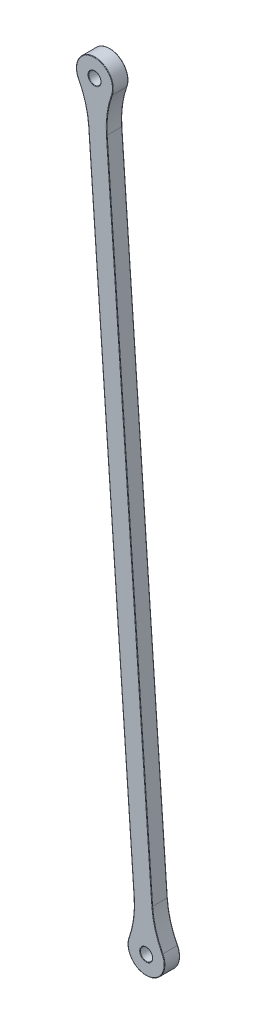
ISO-10303-21;
HEADER;
FILE_DESCRIPTION(('STEP AP214'),'2;1');
FILE_NAME('part.step','',(''),(''),'','','');
FILE_SCHEMA(('AUTOMOTIVE_DESIGN { 1 0 10303 214 1 1 1 1 }'));
ENDSEC;
DATA;
#1=APPLICATION_CONTEXT('core data for automotive mechanical design processes');
#2=APPLICATION_PROTOCOL_DEFINITION('international standard','automotive_design',2000,#1);
#3=PRODUCT_CONTEXT('',#1,'mechanical');
#4=PRODUCT('Part','Part','',(#3));
#5=PRODUCT_RELATED_PRODUCT_CATEGORY('part','',(#4));
#6=PRODUCT_DEFINITION_FORMATION('','',#4);
#7=PRODUCT_DEFINITION_CONTEXT('part definition',#1,'design');
#8=PRODUCT_DEFINITION('design','',#6,#7);
#9=PRODUCT_DEFINITION_SHAPE('','',#8);
#10=(LENGTH_UNIT() NAMED_UNIT(*) SI_UNIT(.MILLI.,.METRE.));
#11=(NAMED_UNIT(*) PLANE_ANGLE_UNIT() SI_UNIT($,.RADIAN.));
#12=(NAMED_UNIT(*) SI_UNIT($,.STERADIAN.) SOLID_ANGLE_UNIT());
#13=UNCERTAINTY_MEASURE_WITH_UNIT(LENGTH_MEASURE(1.E-05),#10,'distance_accuracy_value','');
#14=(GEOMETRIC_REPRESENTATION_CONTEXT(3) GLOBAL_UNCERTAINTY_ASSIGNED_CONTEXT((#13)) GLOBAL_UNIT_ASSIGNED_CONTEXT((#10,
#11,#12)) REPRESENTATION_CONTEXT('',''));
#15=CARTESIAN_POINT('',(0.,0.,0.));
#16=DIRECTION('',(0.,0.,1.));
#17=DIRECTION('',(1.,0.,0.));
#18=AXIS2_PLACEMENT_3D('',#15,#16,#17);
#19=CARTESIAN_POINT('',(33.0209516053081,48.5577457272989,-5.));
#20=DIRECTION('',(0.,0.,1.));
#21=DIRECTION('',(1.,0.,0.));
#22=AXIS2_PLACEMENT_3D('',#19,#20,#21);
#23=CYLINDRICAL_SURFACE('',#22,6.);
#24=DIRECTION('',(0.,0.,1.));
#25=VECTOR('',#24,1.);
#26=CARTESIAN_POINT('',(27.3661007024171,50.5634030425134,-5.));
#27=LINE('',#26,#25);
#28=CARTESIAN_POINT('',(27.3661007024171,50.5634030425134,-0.15));
#29=VERTEX_POINT('',#28);
#30=CARTESIAN_POINT('',(27.3661007024171,50.5634030425134,-4.85));
#31=VERTEX_POINT('',#30);
#32=EDGE_CURVE('E175',#29,#31,#27,.F.);
#33=ORIENTED_EDGE('',*,*,#32,.T.);
#34=CARTESIAN_POINT('',(33.0209516053081,48.5577457272989,-4.85));
#35=DIRECTION('',(0.,0.,1.));
#36=DIRECTION('',(1.,0.,0.));
#37=AXIS2_PLACEMENT_3D('',#34,#35,#36);
#38=CIRCLE('',#37,6.);
#39=CARTESIAN_POINT('',(38.3389298635249,51.3360738657903,-4.85));
#40=VERTEX_POINT('',#39);
#41=EDGE_CURVE('E234',#31,#40,#38,.T.);
#42=ORIENTED_EDGE('',*,*,#41,.T.);
#43=DIRECTION('',(0.,0.,1.));
#44=VECTOR('',#43,1.);
#45=CARTESIAN_POINT('',(38.3389298635249,51.3360738657903,-5.));
#46=LINE('',#45,#44);
#47=CARTESIAN_POINT('',(38.3389298635249,51.3360738657903,-0.15));
#48=VERTEX_POINT('',#47);
#49=EDGE_CURVE('E306',#40,#48,#46,.T.);
#50=ORIENTED_EDGE('',*,*,#49,.T.);
#51=CARTESIAN_POINT('',(33.0209516053081,48.5577457272989,-0.15));
#52=DIRECTION('',(0.,0.,1.));
#53=DIRECTION('',(1.,0.,0.));
#54=AXIS2_PLACEMENT_3D('',#51,#52,#53);
#55=CIRCLE('',#54,6.);
#56=EDGE_CURVE('E232',#48,#29,#55,.F.);
#57=ORIENTED_EDGE('',*,*,#56,.T.);
#58=EDGE_LOOP('',(#33,#42,#50,#57));
#59=FACE_BOUND('',#58,.T.);
#60=ADVANCED_FACE('F40',(#59),#23,.T.);
#61=CARTESIAN_POINT('',(33.26784187544,2.34261286611937,-5.));
#62=DIRECTION('',(0.997529923737068,0.070242802116079,0.));
#63=DIRECTION('',(-0.070242802116079,0.997529923737068,0.));
#64=AXIS2_PLACEMENT_3D('',#61,#62,#63);
#65=PLANE('',#64);
#66=DIRECTION('',(0.,0.,1.));
#67=VECTOR('',#66,1.);
#68=CARTESIAN_POINT('',(14.1807072602602,273.402242656729,-5.));
#69=LINE('',#68,#67);
#70=CARTESIAN_POINT('',(14.1807072602602,273.402242656729,-0.15));
#71=VERTEX_POINT('',#70);
#72=CARTESIAN_POINT('',(14.1807072602602,273.402242656729,-4.85));
#73=VERTEX_POINT('',#72);
#74=EDGE_CURVE('E311',#71,#73,#69,.F.);
#75=ORIENTED_EDGE('',*,*,#74,.T.);
#76=DIRECTION('',(-0.070242802116079,0.997529923737068,0.));
#77=VECTOR('',#76,1.);
#78=CARTESIAN_POINT('',(33.26784187544,2.34261286611937,-4.85));
#79=LINE('',#78,#77);
#80=CARTESIAN_POINT('',(29.0177439000745,62.6989736820684,-4.85));
#81=VERTEX_POINT('',#80);
#82=EDGE_CURVE('E226',#73,#81,#79,.F.);
#83=ORIENTED_EDGE('',*,*,#82,.T.);
#84=DIRECTION('',(0.,0.,1.));
#85=VECTOR('',#84,1.);
#86=CARTESIAN_POINT('',(29.0177439000745,62.6989736820684,-5.));
#87=LINE('',#86,#85);
#88=CARTESIAN_POINT('',(29.0177439000745,62.6989736820684,-0.15));
#89=VERTEX_POINT('',#88);
#90=EDGE_CURVE('E315',#81,#89,#87,.T.);
#91=ORIENTED_EDGE('',*,*,#90,.T.);
#92=DIRECTION('',(-0.070242802116079,0.997529923737068,0.));
#93=VECTOR('',#92,1.);
#94=CARTESIAN_POINT('',(14.1807072602602,273.402242656729,-0.15));
#95=LINE('',#94,#93);
#96=EDGE_CURVE('E224',#89,#71,#95,.T.);
#97=ORIENTED_EDGE('',*,*,#96,.T.);
#98=EDGE_LOOP('',(#75,#83,#91,#97));
#99=FACE_BOUND('',#98,.T.);
#100=ADVANCED_FACE('F352',(#99),#65,.F.);
#101=CARTESIAN_POINT('',(16.1626790974491,287.964927424195,-5.));
#102=DIRECTION('',(0.,0.,1.));
#103=DIRECTION('',(1.,0.,0.));
#104=AXIS2_PLACEMENT_3D('',#101,#102,#103);
#105=CYLINDRICAL_SURFACE('',#104,6.);
#106=DIRECTION('',(0.,0.,1.));
#107=VECTOR('',#106,1.);
#108=CARTESIAN_POINT('',(21.81753000034,285.959270108981,-5.));
#109=LINE('',#108,#107);
#110=CARTESIAN_POINT('',(21.81753000034,285.959270108981,-0.15));
#111=VERTEX_POINT('',#110);
#112=CARTESIAN_POINT('',(21.81753000034,285.959270108981,-4.85));
#113=VERTEX_POINT('',#112);
#114=EDGE_CURVE('E346',#111,#113,#109,.F.);
#115=ORIENTED_EDGE('',*,*,#114,.T.);
#116=CARTESIAN_POINT('',(16.1626790974491,287.964927424195,-4.85));
#117=DIRECTION('',(0.,0.,1.));
#118=DIRECTION('',(1.,0.,0.));
#119=AXIS2_PLACEMENT_3D('',#116,#117,#118);
#120=CIRCLE('',#119,6.);
#121=CARTESIAN_POINT('',(10.8447008392323,285.186599285704,-4.85));
#122=VERTEX_POINT('',#121);
#123=EDGE_CURVE('E217',#113,#122,#120,.T.);
#124=ORIENTED_EDGE('',*,*,#123,.T.);
#125=DIRECTION('',(0.,0.,1.));
#126=VECTOR('',#125,1.);
#127=CARTESIAN_POINT('',(10.8447008392323,285.186599285704,-5.));
#128=LINE('',#127,#126);
#129=CARTESIAN_POINT('',(10.8447008392323,285.186599285704,-0.15));
#130=VERTEX_POINT('',#129);
#131=EDGE_CURVE('E341',#122,#130,#128,.T.);
#132=ORIENTED_EDGE('',*,*,#131,.T.);
#133=CARTESIAN_POINT('',(16.1626790974491,287.964927424195,-0.15));
#134=DIRECTION('',(0.,0.,1.));
#135=DIRECTION('',(1.,0.,0.));
#136=AXIS2_PLACEMENT_3D('',#133,#134,#135);
#137=CIRCLE('',#136,6.);
#138=EDGE_CURVE('E215',#130,#111,#137,.F.);
#139=ORIENTED_EDGE('',*,*,#138,.T.);
#140=EDGE_LOOP('',(#115,#124,#132,#139));
#141=FACE_BOUND('',#140,.T.);
#142=ADVANCED_FACE('F376',(#141),#105,.T.);
#143=CARTESIAN_POINT('',(16.1626790974491,287.964927424195,-5.));
#144=DIRECTION('',(0.,0.,1.));
#145=DIRECTION('',(1.,0.,0.));
#146=AXIS2_PLACEMENT_3D('',#143,#144,#145);
#147=CYLINDRICAL_SURFACE('',#146,2.);
#148=CARTESIAN_POINT('',(16.1626790974491,287.964927424195,-4.85));
#149=DIRECTION('',(0.,0.,1.));
#150=DIRECTION('',(1.,0.,0.));
#151=AXIS2_PLACEMENT_3D('',#148,#149,#150);
#152=CIRCLE('',#151,2.);
#153=CARTESIAN_POINT('',(18.1626790974491,287.964927424195,-4.85));
#154=VERTEX_POINT('',#153);
#155=EDGE_CURVE('E201',#154,#154,#152,.F.);
#156=ORIENTED_EDGE('',*,*,#155,.T.);
#157=EDGE_LOOP('',(#156));
#158=FACE_BOUND('',#157,.T.);
#159=CARTESIAN_POINT('',(16.1626790974491,287.964927424195,-0.15));
#160=DIRECTION('',(0.,0.,1.));
#161=DIRECTION('',(1.,0.,0.));
#162=AXIS2_PLACEMENT_3D('',#159,#160,#161);
#163=CIRCLE('',#162,2.);
#164=CARTESIAN_POINT('',(18.1626790974491,287.964927424195,-0.15));
#165=VERTEX_POINT('',#164);
#166=EDGE_CURVE('E198',#165,#165,#163,.T.);
#167=ORIENTED_EDGE('',*,*,#166,.T.);
#168=EDGE_LOOP('',(#167));
#169=FACE_BOUND('',#168,.T.);
#170=ADVANCED_FACE('F625',(#158,#169),#147,.F.);
#171=CARTESIAN_POINT('',(39.2530214178624,2.76406967881585,-5.));
#172=DIRECTION('',(0.997529923737068,0.070242802116079,0.));
#173=DIRECTION('',(-0.070242802116079,0.997529923737068,0.));
#174=AXIS2_PLACEMENT_3D('',#171,#172,#173);
#175=PLANE('',#174);
#176=DIRECTION('',(0.,0.,-1.));
#177=VECTOR('',#176,1.);
#178=CARTESIAN_POINT('',(35.0029234424969,63.1204304947651,-5.));
#179=LINE('',#178,#177);
#180=CARTESIAN_POINT('',(35.0029234424969,63.1204304947651,-0.15));
#181=VERTEX_POINT('',#180);
#182=CARTESIAN_POINT('',(35.0029234424969,63.1204304947651,-4.85));
#183=VERTEX_POINT('',#182);
#184=EDGE_CURVE('E269',#181,#183,#179,.T.);
#185=ORIENTED_EDGE('',*,*,#184,.T.);
#186=DIRECTION('',(-0.070242802116079,0.997529923737068,0.));
#187=VECTOR('',#186,1.);
#188=CARTESIAN_POINT('',(20.1658868026826,273.823699469426,-4.85));
#189=LINE('',#188,#187);
#190=CARTESIAN_POINT('',(20.1658868026826,273.823699469426,-4.85));
#191=VERTEX_POINT('',#190);
#192=EDGE_CURVE('E209',#183,#191,#189,.T.);
#193=ORIENTED_EDGE('',*,*,#192,.T.);
#194=DIRECTION('',(0.,0.,-1.));
#195=VECTOR('',#194,1.);
#196=CARTESIAN_POINT('',(20.1658868026826,273.823699469426,0.));
#197=LINE('',#196,#195);
#198=CARTESIAN_POINT('',(20.1658868026826,273.823699469426,-0.15));
#199=VERTEX_POINT('',#198);
#200=EDGE_CURVE('E339',#191,#199,#197,.F.);
#201=ORIENTED_EDGE('',*,*,#200,.T.);
#202=DIRECTION('',(-0.070242802116079,0.997529923737068,0.));
#203=VECTOR('',#202,1.);
#204=CARTESIAN_POINT('',(39.2530214178624,2.76406967881585,-0.15));
#205=LINE('',#204,#203);
#206=EDGE_CURVE('E207',#199,#181,#205,.F.);
#207=ORIENTED_EDGE('',*,*,#206,.T.);
#208=EDGE_LOOP('',(#185,#193,#201,#207));
#209=FACE_BOUND('',#208,.T.);
#210=ADVANCED_FACE('F338',(#209),#175,.T.);
#211=CARTESIAN_POINT('',(33.0209516053081,48.5577457272989,-5.));
#212=DIRECTION('',(0.,0.,1.));
#213=DIRECTION('',(1.,0.,0.));
#214=AXIS2_PLACEMENT_3D('',#211,#212,#213);
#215=CYLINDRICAL_SURFACE('',#214,2.);
#216=CARTESIAN_POINT('',(33.0209516053081,48.5577457272989,-4.85));
#217=DIRECTION('',(0.,0.,1.));
#218=DIRECTION('',(1.,0.,0.));
#219=AXIS2_PLACEMENT_3D('',#216,#217,#218);
#220=CIRCLE('',#219,2.);
#221=CARTESIAN_POINT('',(35.0209516053081,48.5577457272989,-4.85));
#222=VERTEX_POINT('',#221);
#223=EDGE_CURVE('E195',#222,#222,#220,.F.);
#224=ORIENTED_EDGE('',*,*,#223,.T.);
#225=EDGE_LOOP('',(#224));
#226=FACE_BOUND('',#225,.T.);
#227=CARTESIAN_POINT('',(33.0209516053081,48.5577457272989,-0.15));
#228=DIRECTION('',(0.,0.,1.));
#229=DIRECTION('',(1.,0.,0.));
#230=AXIS2_PLACEMENT_3D('',#227,#228,#229);
#231=CIRCLE('',#230,2.);
#232=CARTESIAN_POINT('',(35.0209516053081,48.5577457272989,-0.15));
#233=VERTEX_POINT('',#232);
#234=EDGE_CURVE('E192',#233,#233,#231,.T.);
#235=ORIENTED_EDGE('',*,*,#234,.T.);
#236=EDGE_LOOP('',(#235));
#237=FACE_BOUND('',#236,.T.);
#238=ADVANCED_FACE('F610',(#226,#237),#215,.F.);
#239=CARTESIAN_POINT('',(0.,0.,-5.));
#240=DIRECTION('',(0.,0.,1.));
#241=DIRECTION('',(1.,0.,0.));
#242=AXIS2_PLACEMENT_3D('',#239,#240,#241);
#243=PLANE('',#242);
#244=CARTESIAN_POINT('',(33.0209516053081,48.5577457272989,-5.));
#245=DIRECTION('',(0.,0.,1.));
#246=DIRECTION('',(1.,0.,0.));
#247=AXIS2_PLACEMENT_3D('',#244,#245,#246);
#248=CIRCLE('',#247,2.15);
#249=CARTESIAN_POINT('',(35.1709516053081,48.5577457272989,-5.));
#250=VERTEX_POINT('',#249);
#251=EDGE_CURVE('E184',#250,#250,#248,.T.);
#252=ORIENTED_EDGE('',*,*,#251,.T.);
#253=EDGE_LOOP('',(#252));
#254=FACE_BOUND('',#253,.T.);
#255=CARTESIAN_POINT('',(16.1626790974491,287.964927424195,-5.));
#256=DIRECTION('',(0.,0.,1.));
#257=DIRECTION('',(1.,0.,0.));
#258=AXIS2_PLACEMENT_3D('',#255,#256,#257);
#259=CIRCLE('',#258,2.15);
#260=CARTESIAN_POINT('',(18.3126790974491,287.964927424195,-5.));
#261=VERTEX_POINT('',#260);
#262=EDGE_CURVE('E181',#261,#261,#259,.T.);
#263=ORIENTED_EDGE('',*,*,#262,.T.);
#264=EDGE_LOOP('',(#263));
#265=FACE_BOUND('',#264,.T.);
#266=DIRECTION('',(-0.070242802116079,0.997529923737068,0.));
#267=VECTOR('',#266,1.);
#268=CARTESIAN_POINT('',(34.8532939539363,63.1098940744477,-5.));
#269=LINE('',#268,#267);
#270=CARTESIAN_POINT('',(20.016257314122,273.813163049108,-5.));
#271=VERTEX_POINT('',#270);
#272=CARTESIAN_POINT('',(34.8532939539363,63.1098940744477,-5.));
#273=VERTEX_POINT('',#272);
#274=EDGE_CURVE('E179',#271,#273,#269,.F.);
#275=ORIENTED_EDGE('',*,*,#274,.T.);
#276=CARTESIAN_POINT('',(64.928821154609,65.2277145582475,-5.));
#277=DIRECTION('',(0.,0.,1.));
#278=DIRECTION('',(1.,0.,0.));
#279=AXIS2_PLACEMENT_3D('',#276,#277,#278);
#280=CIRCLE('',#279,30.15);
#281=CARTESIAN_POINT('',(38.2059804070695,51.266615662328,-5.));
#282=VERTEX_POINT('',#281);
#283=EDGE_CURVE('E160',#273,#282,#280,.T.);
#284=ORIENTED_EDGE('',*,*,#283,.T.);
#285=CARTESIAN_POINT('',(33.0209516053081,48.5577457272989,-5.));
#286=DIRECTION('',(0.,0.,1.));
#287=DIRECTION('',(1.,0.,0.));
#288=AXIS2_PLACEMENT_3D('',#285,#286,#287);
#289=CIRCLE('',#288,5.85);
#290=CARTESIAN_POINT('',(27.5074719749894,50.513261609633,-5.));
#291=VERTEX_POINT('',#290);
#292=EDGE_CURVE('E168',#282,#291,#289,.F.);
#293=ORIENTED_EDGE('',*,*,#292,.T.);
#294=CARTESIAN_POINT('',(-0.90815381203754,60.5916896185861,-5.));
#295=DIRECTION('',(0.,0.,1.));
#296=DIRECTION('',(1.,0.,0.));
#297=AXIS2_PLACEMENT_3D('',#294,#295,#296);
#298=CIRCLE('',#297,30.15);
#299=CARTESIAN_POINT('',(29.1673733886351,62.7095101023858,-5.));
#300=VERTEX_POINT('',#299);
#301=EDGE_CURVE('E174',#291,#300,#298,.T.);
#302=ORIENTED_EDGE('',*,*,#301,.T.);
#303=DIRECTION('',(-0.070242802116079,0.997529923737068,0.));
#304=VECTOR('',#303,1.);
#305=CARTESIAN_POINT('',(33.4174713640005,2.35314928643679,-5.));
#306=LINE('',#305,#304);
#307=CARTESIAN_POINT('',(14.3303367488208,273.412779077047,-5.));
#308=VERTEX_POINT('',#307);
#309=EDGE_CURVE('E320',#300,#308,#306,.T.);
#310=ORIENTED_EDGE('',*,*,#309,.T.);
#311=CARTESIAN_POINT('',(-15.7451904518519,271.294958593247,-5.));
#312=DIRECTION('',(0.,0.,1.));
#313=DIRECTION('',(1.,0.,0.));
#314=AXIS2_PLACEMENT_3D('',#311,#312,#313);
#315=CIRCLE('',#314,30.15);
#316=CARTESIAN_POINT('',(10.9776502956877,285.256057489166,-5.));
#317=VERTEX_POINT('',#316);
#318=EDGE_CURVE('E322',#308,#317,#315,.T.);
#319=ORIENTED_EDGE('',*,*,#318,.T.);
#320=CARTESIAN_POINT('',(16.1626790974491,287.964927424195,-5.));
#321=DIRECTION('',(0.,0.,1.));
#322=DIRECTION('',(1.,0.,0.));
#323=AXIS2_PLACEMENT_3D('',#320,#321,#322);
#324=CIRCLE('',#323,5.85);
#325=CARTESIAN_POINT('',(21.6761587277678,286.009411541861,-5.));
#326=VERTEX_POINT('',#325);
#327=EDGE_CURVE('E324',#317,#326,#324,.F.);
#328=ORIENTED_EDGE('',*,*,#327,.T.);
#329=CARTESIAN_POINT('',(50.0917845147947,275.930983532908,-5.));
#330=DIRECTION('',(0.,0.,1.));
#331=DIRECTION('',(1.,0.,0.));
#332=AXIS2_PLACEMENT_3D('',#329,#330,#331);
#333=CIRCLE('',#332,30.15);
#334=EDGE_CURVE('E186',#326,#271,#333,.T.);
#335=ORIENTED_EDGE('',*,*,#334,.T.);
#336=EDGE_LOOP('',(#275,#284,#293,#302,#310,#319,#328,#335));
#337=FACE_BOUND('',#336,.T.);
#338=ADVANCED_FACE('F177',(#254,#265,#337),#243,.F.);
#339=CARTESIAN_POINT('',(0.,0.,0.));
#340=DIRECTION('',(0.,0.,1.));
#341=DIRECTION('',(1.,0.,0.));
#342=AXIS2_PLACEMENT_3D('',#339,#340,#341);
#343=PLANE('',#342);
#344=CARTESIAN_POINT('',(33.0209516053081,48.5577457272989,0.));
#345=DIRECTION('',(0.,0.,1.));
#346=DIRECTION('',(1.,0.,0.));
#347=AXIS2_PLACEMENT_3D('',#344,#345,#346);
#348=CIRCLE('',#347,2.15);
#349=CARTESIAN_POINT('',(35.1709516053081,48.5577457272989,0.));
#350=VERTEX_POINT('',#349);
#351=EDGE_CURVE('E11',#350,#350,#348,.F.);
#352=ORIENTED_EDGE('',*,*,#351,.T.);
#353=EDGE_LOOP('',(#352));
#354=FACE_BOUND('',#353,.T.);
#355=CARTESIAN_POINT('',(16.1626790974491,287.964927424195,0.));
#356=DIRECTION('',(0.,0.,1.));
#357=DIRECTION('',(1.,0.,0.));
#358=AXIS2_PLACEMENT_3D('',#355,#356,#357);
#359=CIRCLE('',#358,2.15);
#360=CARTESIAN_POINT('',(18.3126790974491,287.964927424195,0.));
#361=VERTEX_POINT('',#360);
#362=EDGE_CURVE('E49',#361,#361,#359,.F.);
#363=ORIENTED_EDGE('',*,*,#362,.T.);
#364=EDGE_LOOP('',(#363));
#365=FACE_BOUND('',#364,.T.);
#366=CARTESIAN_POINT('',(16.1626790974491,287.964927424195,0.));
#367=DIRECTION('',(0.,0.,1.));
#368=DIRECTION('',(1.,0.,0.));
#369=AXIS2_PLACEMENT_3D('',#366,#367,#368);
#370=CIRCLE('',#369,5.85);
#371=CARTESIAN_POINT('',(21.6761587277678,286.009411541861,0.));
#372=VERTEX_POINT('',#371);
#373=CARTESIAN_POINT('',(10.9776502956877,285.256057489166,0.));
#374=VERTEX_POINT('',#373);
#375=EDGE_CURVE('E57',#372,#374,#370,.T.);
#376=ORIENTED_EDGE('',*,*,#375,.T.);
#377=CARTESIAN_POINT('',(-15.7451904518519,271.294958593247,0.));
#378=DIRECTION('',(0.,0.,1.));
#379=DIRECTION('',(1.,0.,0.));
#380=AXIS2_PLACEMENT_3D('',#377,#378,#379);
#381=CIRCLE('',#380,30.15);
#382=CARTESIAN_POINT('',(14.3303367488208,273.412779077047,0.));
#383=VERTEX_POINT('',#382);
#384=EDGE_CURVE('E248',#374,#383,#381,.F.);
#385=ORIENTED_EDGE('',*,*,#384,.T.);
#386=DIRECTION('',(-0.070242802116079,0.997529923737068,0.));
#387=VECTOR('',#386,1.);
#388=CARTESIAN_POINT('',(29.1673733886351,62.7095101023859,0.));
#389=LINE('',#388,#387);
#390=CARTESIAN_POINT('',(29.1673733886351,62.7095101023858,0.));
#391=VERTEX_POINT('',#390);
#392=EDGE_CURVE('E236',#383,#391,#389,.F.);
#393=ORIENTED_EDGE('',*,*,#392,.T.);
#394=CARTESIAN_POINT('',(-0.90815381203754,60.5916896185861,0.));
#395=DIRECTION('',(0.,0.,1.));
#396=DIRECTION('',(1.,0.,0.));
#397=AXIS2_PLACEMENT_3D('',#394,#395,#396);
#398=CIRCLE('',#397,30.15);
#399=CARTESIAN_POINT('',(27.5074719749894,50.513261609633,0.));
#400=VERTEX_POINT('',#399);
#401=EDGE_CURVE('E238',#391,#400,#398,.F.);
#402=ORIENTED_EDGE('',*,*,#401,.T.);
#403=CARTESIAN_POINT('',(33.0209516053081,48.5577457272989,0.));
#404=DIRECTION('',(0.,0.,1.));
#405=DIRECTION('',(1.,0.,0.));
#406=AXIS2_PLACEMENT_3D('',#403,#404,#405);
#407=CIRCLE('',#406,5.85);
#408=CARTESIAN_POINT('',(38.2059804070695,51.266615662328,0.));
#409=VERTEX_POINT('',#408);
#410=EDGE_CURVE('E240',#400,#409,#407,.T.);
#411=ORIENTED_EDGE('',*,*,#410,.T.);
#412=CARTESIAN_POINT('',(64.928821154609,65.2277145582475,0.));
#413=DIRECTION('',(0.,0.,1.));
#414=DIRECTION('',(1.,0.,0.));
#415=AXIS2_PLACEMENT_3D('',#412,#413,#414);
#416=CIRCLE('',#415,30.15);
#417=CARTESIAN_POINT('',(34.8532939539363,63.1098940744477,0.));
#418=VERTEX_POINT('',#417);
#419=EDGE_CURVE('E242',#409,#418,#416,.F.);
#420=ORIENTED_EDGE('',*,*,#419,.T.);
#421=DIRECTION('',(-0.070242802116079,0.997529923737068,0.));
#422=VECTOR('',#421,1.);
#423=CARTESIAN_POINT('',(39.1033919293018,2.75353325849844,0.));
#424=LINE('',#423,#422);
#425=CARTESIAN_POINT('',(20.016257314122,273.813163049108,0.));
#426=VERTEX_POINT('',#425);
#427=EDGE_CURVE('E244',#418,#426,#424,.T.);
#428=ORIENTED_EDGE('',*,*,#427,.T.);
#429=CARTESIAN_POINT('',(50.0917845147947,275.930983532908,0.));
#430=DIRECTION('',(0.,0.,1.));
#431=DIRECTION('',(1.,0.,0.));
#432=AXIS2_PLACEMENT_3D('',#429,#430,#431);
#433=CIRCLE('',#432,30.15);
#434=EDGE_CURVE('E62',#426,#372,#433,.F.);
#435=ORIENTED_EDGE('',*,*,#434,.T.);
#436=EDGE_LOOP('',(#376,#385,#393,#402,#411,#420,#428,#435));
#437=FACE_BOUND('',#436,.T.);
#438=ADVANCED_FACE('F395',(#354,#365,#437),#343,.T.);
#439=CARTESIAN_POINT('',(50.0917845147947,275.930983532908,-5.));
#440=DIRECTION('',(0.,0.,1.));
#441=DIRECTION('',(1.,0.,0.));
#442=AXIS2_PLACEMENT_3D('',#439,#440,#441);
#443=CYLINDRICAL_SURFACE('',#442,30.);
#444=ORIENTED_EDGE('',*,*,#200,.F.);
#445=CARTESIAN_POINT('',(50.0917845147947,275.930983532908,-4.85));
#446=DIRECTION('',(0.,0.,1.));
#447=DIRECTION('',(1.,0.,0.));
#448=AXIS2_PLACEMENT_3D('',#445,#446,#447);
#449=CIRCLE('',#448,30.);
#450=EDGE_CURVE('E213',#191,#113,#449,.F.);
#451=ORIENTED_EDGE('',*,*,#450,.T.);
#452=ORIENTED_EDGE('',*,*,#114,.F.);
#453=CARTESIAN_POINT('',(50.0917845147947,275.930983532908,-0.15));
#454=DIRECTION('',(0.,0.,1.));
#455=DIRECTION('',(1.,0.,0.));
#456=AXIS2_PLACEMENT_3D('',#453,#454,#455);
#457=CIRCLE('',#456,30.);
#458=EDGE_CURVE('E211',#111,#199,#457,.T.);
#459=ORIENTED_EDGE('',*,*,#458,.T.);
#460=EDGE_LOOP('',(#444,#451,#452,#459));
#461=FACE_BOUND('',#460,.T.);
#462=ADVANCED_FACE('F418',(#461),#443,.F.);
#463=CARTESIAN_POINT('',(-15.7451904518519,271.294958593247,-5.));
#464=DIRECTION('',(0.,0.,1.));
#465=DIRECTION('',(1.,0.,0.));
#466=AXIS2_PLACEMENT_3D('',#463,#464,#465);
#467=CYLINDRICAL_SURFACE('',#466,30.);
#468=ORIENTED_EDGE('',*,*,#131,.F.);
#469=CARTESIAN_POINT('',(-15.7451904518519,271.294958593247,-4.85));
#470=DIRECTION('',(0.,0.,1.));
#471=DIRECTION('',(1.,0.,0.));
#472=AXIS2_PLACEMENT_3D('',#469,#470,#471);
#473=CIRCLE('',#472,30.);
#474=EDGE_CURVE('E222',#122,#73,#473,.F.);
#475=ORIENTED_EDGE('',*,*,#474,.T.);
#476=ORIENTED_EDGE('',*,*,#74,.F.);
#477=CARTESIAN_POINT('',(-15.7451904518519,271.294958593247,-0.15));
#478=DIRECTION('',(0.,0.,1.));
#479=DIRECTION('',(1.,0.,0.));
#480=AXIS2_PLACEMENT_3D('',#477,#478,#479);
#481=CIRCLE('',#480,30.);
#482=EDGE_CURVE('E219',#71,#130,#481,.T.);
#483=ORIENTED_EDGE('',*,*,#482,.T.);
#484=EDGE_LOOP('',(#468,#475,#476,#483));
#485=FACE_BOUND('',#484,.T.);
#486=ADVANCED_FACE('F373',(#485),#467,.F.);
#487=CARTESIAN_POINT('',(-0.90815381203754,60.5916896185861,-5.));
#488=DIRECTION('',(0.,0.,1.));
#489=DIRECTION('',(1.,0.,0.));
#490=AXIS2_PLACEMENT_3D('',#487,#488,#489);
#491=CYLINDRICAL_SURFACE('',#490,30.);
#492=ORIENTED_EDGE('',*,*,#90,.F.);
#493=CARTESIAN_POINT('',(-0.90815381203754,60.5916896185861,-4.85));
#494=DIRECTION('',(0.,0.,1.));
#495=DIRECTION('',(1.,0.,0.));
#496=AXIS2_PLACEMENT_3D('',#493,#494,#495);
#497=CIRCLE('',#496,30.);
#498=EDGE_CURVE('E230',#81,#31,#497,.F.);
#499=ORIENTED_EDGE('',*,*,#498,.T.);
#500=ORIENTED_EDGE('',*,*,#32,.F.);
#501=CARTESIAN_POINT('',(-0.90815381203754,60.5916896185861,-0.15));
#502=DIRECTION('',(0.,0.,1.));
#503=DIRECTION('',(1.,0.,0.));
#504=AXIS2_PLACEMENT_3D('',#501,#502,#503);
#505=CIRCLE('',#504,30.);
#506=EDGE_CURVE('E228',#29,#89,#505,.T.);
#507=ORIENTED_EDGE('',*,*,#506,.T.);
#508=EDGE_LOOP('',(#492,#499,#500,#507));
#509=FACE_BOUND('',#508,.T.);
#510=ADVANCED_FACE('F392',(#509),#491,.F.);
#511=CARTESIAN_POINT('',(64.928821154609,65.2277145582475,-5.));
#512=DIRECTION('',(0.,0.,1.));
#513=DIRECTION('',(1.,0.,0.));
#514=AXIS2_PLACEMENT_3D('',#511,#512,#513);
#515=CYLINDRICAL_SURFACE('',#514,30.);
#516=ORIENTED_EDGE('',*,*,#49,.F.);
#517=CARTESIAN_POINT('',(64.928821154609,65.2277145582475,-4.85));
#518=DIRECTION('',(0.,0.,1.));
#519=DIRECTION('',(1.,0.,0.));
#520=AXIS2_PLACEMENT_3D('',#517,#518,#519);
#521=CIRCLE('',#520,30.);
#522=EDGE_CURVE('E162',#40,#183,#521,.F.);
#523=ORIENTED_EDGE('',*,*,#522,.T.);
#524=ORIENTED_EDGE('',*,*,#184,.F.);
#525=CARTESIAN_POINT('',(64.928821154609,65.2277145582475,-0.15));
#526=DIRECTION('',(0.,0.,1.));
#527=DIRECTION('',(1.,0.,0.));
#528=AXIS2_PLACEMENT_3D('',#525,#526,#527);
#529=CIRCLE('',#528,30.);
#530=EDGE_CURVE('E204',#181,#48,#529,.T.);
#531=ORIENTED_EDGE('',*,*,#530,.T.);
#532=EDGE_LOOP('',(#516,#523,#524,#531));
#533=FACE_BOUND('',#532,.T.);
#534=ADVANCED_FACE('F305',(#533),#515,.F.);
#535=CARTESIAN_POINT('',(33.0209516053081,48.5577457272989,-4.85));
#536=DIRECTION('',(0.,0.,1.));
#537=DIRECTION('',(1.,0.,0.));
#538=AXIS2_PLACEMENT_3D('',#535,#536,#537);
#539=TOROIDAL_SURFACE('',#538,2.15,0.15);
#540=ORIENTED_EDGE('',*,*,#223,.F.);
#541=EDGE_LOOP('',(#540));
#542=FACE_BOUND('',#541,.T.);
#543=ORIENTED_EDGE('',*,*,#251,.F.);
#544=EDGE_LOOP('',(#543));
#545=FACE_BOUND('',#544,.T.);
#546=ADVANCED_FACE('F428',(#542,#545),#539,.T.);
#547=CARTESIAN_POINT('',(16.1626790974491,287.964927424195,-4.85));
#548=DIRECTION('',(0.,0.,1.));
#549=DIRECTION('',(1.,0.,0.));
#550=AXIS2_PLACEMENT_3D('',#547,#548,#549);
#551=TOROIDAL_SURFACE('',#550,2.15,0.15);
#552=ORIENTED_EDGE('',*,*,#155,.F.);
#553=EDGE_LOOP('',(#552));
#554=FACE_BOUND('',#553,.T.);
#555=ORIENTED_EDGE('',*,*,#262,.F.);
#556=EDGE_LOOP('',(#555));
#557=FACE_BOUND('',#556,.T.);
#558=ADVANCED_FACE('F431',(#554,#557),#551,.T.);
#559=CARTESIAN_POINT('',(-15.7451904518519,271.294958593247,-4.85));
#560=DIRECTION('',(0.,0.,1.));
#561=DIRECTION('',(1.,0.,0.));
#562=AXIS2_PLACEMENT_3D('',#559,#560,#561);
#563=TOROIDAL_SURFACE('',#562,30.15,0.15);
#564=CARTESIAN_POINT('',(14.3303367488208,273.412779077047,-4.85));
#565=DIRECTION('',(0.0702428021159834,-0.997529923737075,0.));
#566=DIRECTION('',(0.997529923737075,0.0702428021159834,0.));
#567=AXIS2_PLACEMENT_3D('',#564,#565,#566);
#568=CIRCLE('',#567,0.15);
#569=EDGE_CURVE('E263',#73,#308,#568,.T.);
#570=ORIENTED_EDGE('',*,*,#569,.F.);
#571=ORIENTED_EDGE('',*,*,#474,.F.);
#572=CARTESIAN_POINT('',(10.9776502956877,285.256057489166,-4.85));
#573=DIRECTION('',(-0.463054689748466,0.886329709702858,0.));
#574=DIRECTION('',(-0.886329709702858,-0.463054689748466,0.));
#575=AXIS2_PLACEMENT_3D('',#572,#573,#574);
#576=CIRCLE('',#575,0.15);
#577=EDGE_CURVE('E266',#317,#122,#576,.T.);
#578=ORIENTED_EDGE('',*,*,#577,.F.);
#579=ORIENTED_EDGE('',*,*,#318,.F.);
#580=EDGE_LOOP('',(#570,#571,#578,#579));
#581=FACE_BOUND('',#580,.T.);
#582=ADVANCED_FACE('F385',(#581),#563,.T.);
#583=CARTESIAN_POINT('',(16.1626790974491,287.964927424195,-4.85));
#584=DIRECTION('',(0.,0.,1.));
#585=DIRECTION('',(1.,0.,0.));
#586=AXIS2_PLACEMENT_3D('',#583,#584,#585);
#587=TOROIDAL_SURFACE('',#586,5.85,0.15);
#588=ORIENTED_EDGE('',*,*,#577,.T.);
#589=ORIENTED_EDGE('',*,*,#123,.F.);
#590=CARTESIAN_POINT('',(21.6761587277678,286.009411541861,-4.85));
#591=DIRECTION('',(-0.334276219202303,-0.942475150481865,0.));
#592=DIRECTION('',(0.942475150481865,-0.334276219202303,0.));
#593=AXIS2_PLACEMENT_3D('',#590,#591,#592);
#594=CIRCLE('',#593,0.15);
#595=EDGE_CURVE('E260',#326,#113,#594,.T.);
#596=ORIENTED_EDGE('',*,*,#595,.F.);
#597=ORIENTED_EDGE('',*,*,#327,.F.);
#598=EDGE_LOOP('',(#588,#589,#596,#597));
#599=FACE_BOUND('',#598,.T.);
#600=ADVANCED_FACE('F380',(#599),#587,.T.);
#601=CARTESIAN_POINT('',(33.4174713640005,2.35314928643679,-4.85));
#602=DIRECTION('',(-0.070242802116079,0.997529923737068,0.));
#603=DIRECTION('',(-0.997529923737068,-0.070242802116079,0.));
#604=AXIS2_PLACEMENT_3D('',#601,#602,#603);
#605=CYLINDRICAL_SURFACE('',#604,0.15);
#606=ORIENTED_EDGE('',*,*,#569,.T.);
#607=ORIENTED_EDGE('',*,*,#309,.F.);
#608=CARTESIAN_POINT('',(29.1673733886351,62.7095101023858,-4.85));
#609=DIRECTION('',(0.0702428021160746,-0.997529923737069,0.));
#610=DIRECTION('',(0.997529923737069,0.0702428021160747,0.));
#611=AXIS2_PLACEMENT_3D('',#608,#609,#610);
#612=CIRCLE('',#611,0.15);
#613=EDGE_CURVE('E257',#81,#300,#612,.T.);
#614=ORIENTED_EDGE('',*,*,#613,.F.);
#615=ORIENTED_EDGE('',*,*,#82,.F.);
#616=EDGE_LOOP('',(#606,#607,#614,#615));
#617=FACE_BOUND('',#616,.T.);
#618=ADVANCED_FACE('F388',(#617),#605,.T.);
#619=CARTESIAN_POINT('',(50.0917845147947,275.930983532908,-4.85));
#620=DIRECTION('',(0.,0.,1.));
#621=DIRECTION('',(1.,0.,0.));
#622=AXIS2_PLACEMENT_3D('',#619,#620,#621);
#623=TOROIDAL_SURFACE('',#622,30.15,0.15);
#624=ORIENTED_EDGE('',*,*,#595,.T.);
#625=ORIENTED_EDGE('',*,*,#450,.F.);
#626=CARTESIAN_POINT('',(20.016257314122,273.813163049108,-4.85));
#627=DIRECTION('',(0.0702428021159826,-0.997529923737075,0.));
#628=DIRECTION('',(0.997529923737075,0.0702428021159826,0.));
#629=AXIS2_PLACEMENT_3D('',#626,#627,#628);
#630=CIRCLE('',#629,0.15);
#631=EDGE_CURVE('E254',#271,#191,#630,.T.);
#632=ORIENTED_EDGE('',*,*,#631,.F.);
#633=ORIENTED_EDGE('',*,*,#334,.F.);
#634=EDGE_LOOP('',(#624,#625,#632,#633));
#635=FACE_BOUND('',#634,.T.);
#636=ADVANCED_FACE('F331',(#635),#623,.T.);
#637=CARTESIAN_POINT('',(-0.90815381203754,60.5916896185861,-4.85));
#638=DIRECTION('',(0.,0.,1.));
#639=DIRECTION('',(1.,0.,0.));
#640=AXIS2_PLACEMENT_3D('',#637,#638,#639);
#641=TOROIDAL_SURFACE('',#640,30.15,0.15);
#642=ORIENTED_EDGE('',*,*,#613,.T.);
#643=ORIENTED_EDGE('',*,*,#301,.F.);
#644=CARTESIAN_POINT('',(27.5074719749894,50.513261609633,-4.85));
#645=DIRECTION('',(-0.3342762192024,-0.942475150481831,0.));
#646=DIRECTION('',(0.942475150481831,-0.3342762192024,0.));
#647=AXIS2_PLACEMENT_3D('',#644,#645,#646);
#648=CIRCLE('',#647,0.15);
#649=EDGE_CURVE('E171',#31,#291,#648,.T.);
#650=ORIENTED_EDGE('',*,*,#649,.F.);
#651=ORIENTED_EDGE('',*,*,#498,.F.);
#652=EDGE_LOOP('',(#642,#643,#650,#651));
#653=FACE_BOUND('',#652,.T.);
#654=ADVANCED_FACE('F391',(#653),#641,.T.);
#655=CARTESIAN_POINT('',(39.1033919293018,2.75353325849844,-4.85));
#656=DIRECTION('',(0.070242802116079,-0.997529923737068,0.));
#657=DIRECTION('',(0.997529923737068,0.070242802116079,0.));
#658=AXIS2_PLACEMENT_3D('',#655,#656,#657);
#659=CYLINDRICAL_SURFACE('',#658,0.15);
#660=ORIENTED_EDGE('',*,*,#631,.T.);
#661=ORIENTED_EDGE('',*,*,#192,.F.);
#662=CARTESIAN_POINT('',(34.8532939539363,63.1098940744477,-4.85));
#663=DIRECTION('',(0.070242802116073,-0.997529923737069,0.));
#664=DIRECTION('',(0.997529923737069,0.070242802116073,0.));
#665=AXIS2_PLACEMENT_3D('',#662,#663,#664);
#666=CIRCLE('',#665,0.15);
#667=EDGE_CURVE('E165',#273,#183,#666,.T.);
#668=ORIENTED_EDGE('',*,*,#667,.F.);
#669=ORIENTED_EDGE('',*,*,#274,.F.);
#670=EDGE_LOOP('',(#660,#661,#668,#669));
#671=FACE_BOUND('',#670,.T.);
#672=ADVANCED_FACE('F334',(#671),#659,.T.);
#673=CARTESIAN_POINT('',(33.0209516053081,48.5577457272989,-4.85));
#674=DIRECTION('',(0.,0.,1.));
#675=DIRECTION('',(1.,0.,0.));
#676=AXIS2_PLACEMENT_3D('',#673,#674,#675);
#677=TOROIDAL_SURFACE('',#676,5.85,0.15);
#678=ORIENTED_EDGE('',*,*,#649,.T.);
#679=ORIENTED_EDGE('',*,*,#292,.F.);
#680=CARTESIAN_POINT('',(38.2059804070695,51.266615662328,-4.85));
#681=DIRECTION('',(-0.463054689748553,0.886329709702812,0.));
#682=DIRECTION('',(-0.886329709702812,-0.463054689748553,0.));
#683=AXIS2_PLACEMENT_3D('',#680,#681,#682);
#684=CIRCLE('',#683,0.15);
#685=EDGE_CURVE('E156',#40,#282,#684,.T.);
#686=ORIENTED_EDGE('',*,*,#685,.F.);
#687=ORIENTED_EDGE('',*,*,#41,.F.);
#688=EDGE_LOOP('',(#678,#679,#686,#687));
#689=FACE_BOUND('',#688,.T.);
#690=ADVANCED_FACE('F169',(#689),#677,.T.);
#691=CARTESIAN_POINT('',(64.928821154609,65.2277145582475,-4.85));
#692=DIRECTION('',(0.,0.,1.));
#693=DIRECTION('',(1.,0.,0.));
#694=AXIS2_PLACEMENT_3D('',#691,#692,#693);
#695=TOROIDAL_SURFACE('',#694,30.15,0.15);
#696=ORIENTED_EDGE('',*,*,#667,.T.);
#697=ORIENTED_EDGE('',*,*,#522,.F.);
#698=ORIENTED_EDGE('',*,*,#685,.T.);
#699=ORIENTED_EDGE('',*,*,#283,.F.);
#700=EDGE_LOOP('',(#696,#697,#698,#699));
#701=FACE_BOUND('',#700,.T.);
#702=ADVANCED_FACE('F158',(#701),#695,.T.);
#703=CARTESIAN_POINT('',(33.0209516053081,48.5577457272989,-0.15));
#704=DIRECTION('',(0.,0.,1.));
#705=DIRECTION('',(1.,0.,0.));
#706=AXIS2_PLACEMENT_3D('',#703,#704,#705);
#707=TOROIDAL_SURFACE('',#706,2.15,0.15);
#708=ORIENTED_EDGE('',*,*,#351,.F.);
#709=EDGE_LOOP('',(#708));
#710=FACE_BOUND('',#709,.T.);
#711=ORIENTED_EDGE('',*,*,#234,.F.);
#712=EDGE_LOOP('',(#711));
#713=FACE_BOUND('',#712,.T.);
#714=ADVANCED_FACE('F438',(#710,#713),#707,.T.);
#715=CARTESIAN_POINT('',(16.1626790974491,287.964927424195,-0.15));
#716=DIRECTION('',(0.,0.,1.));
#717=DIRECTION('',(1.,0.,0.));
#718=AXIS2_PLACEMENT_3D('',#715,#716,#717);
#719=TOROIDAL_SURFACE('',#718,2.15,0.15);
#720=ORIENTED_EDGE('',*,*,#362,.F.);
#721=EDGE_LOOP('',(#720));
#722=FACE_BOUND('',#721,.T.);
#723=ORIENTED_EDGE('',*,*,#166,.F.);
#724=EDGE_LOOP('',(#723));
#725=FACE_BOUND('',#724,.T.);
#726=ADVANCED_FACE('F455',(#722,#725),#719,.T.);
#727=CARTESIAN_POINT('',(64.928821154609,65.2277145582475,-0.15));
#728=DIRECTION('',(0.,0.,1.));
#729=DIRECTION('',(1.,0.,0.));
#730=AXIS2_PLACEMENT_3D('',#727,#728,#729);
#731=TOROIDAL_SURFACE('',#730,30.15,0.15);
#732=CARTESIAN_POINT('',(38.2059804070695,51.266615662328,-0.15));
#733=DIRECTION('',(0.463054689748553,-0.886329709702812,0.));
#734=DIRECTION('',(0.886329709702812,0.463054689748553,0.));
#735=AXIS2_PLACEMENT_3D('',#732,#733,#734);
#736=CIRCLE('',#735,0.15);
#737=EDGE_CURVE('E285',#48,#409,#736,.T.);
#738=ORIENTED_EDGE('',*,*,#737,.F.);
#739=ORIENTED_EDGE('',*,*,#530,.F.);
#740=CARTESIAN_POINT('',(34.8532939539363,63.1098940744477,-0.15));
#741=DIRECTION('',(-0.070242802116073,0.997529923737069,0.));
#742=DIRECTION('',(-0.997529923737069,-0.070242802116073,0.));
#743=AXIS2_PLACEMENT_3D('',#740,#741,#742);
#744=CIRCLE('',#743,0.15);
#745=EDGE_CURVE('E44',#418,#181,#744,.T.);
#746=ORIENTED_EDGE('',*,*,#745,.F.);
#747=ORIENTED_EDGE('',*,*,#419,.F.);
#748=EDGE_LOOP('',(#738,#739,#746,#747));
#749=FACE_BOUND('',#748,.T.);
#750=ADVANCED_FACE('F42',(#749),#731,.T.);
#751=CARTESIAN_POINT('',(39.1033919293018,2.75353325849844,-0.15));
#752=DIRECTION('',(-0.070242802116079,0.997529923737068,0.));
#753=DIRECTION('',(-0.997529923737068,-0.070242802116079,0.));
#754=AXIS2_PLACEMENT_3D('',#751,#752,#753);
#755=CYLINDRICAL_SURFACE('',#754,0.15);
#756=ORIENTED_EDGE('',*,*,#745,.T.);
#757=ORIENTED_EDGE('',*,*,#206,.F.);
#758=CARTESIAN_POINT('',(20.016257314122,273.813163049108,-0.15));
#759=DIRECTION('',(-0.0702428021159826,0.997529923737075,0.));
#760=DIRECTION('',(-0.997529923737075,-0.0702428021159826,0.));
#761=AXIS2_PLACEMENT_3D('',#758,#759,#760);
#762=CIRCLE('',#761,0.15);
#763=EDGE_CURVE('E283',#426,#199,#762,.T.);
#764=ORIENTED_EDGE('',*,*,#763,.F.);
#765=ORIENTED_EDGE('',*,*,#427,.F.);
#766=EDGE_LOOP('',(#756,#757,#764,#765));
#767=FACE_BOUND('',#766,.T.);
#768=ADVANCED_FACE('F296',(#767),#755,.T.);
#769=CARTESIAN_POINT('',(33.0209516053081,48.5577457272989,-0.15));
#770=DIRECTION('',(0.,0.,1.));
#771=DIRECTION('',(1.,0.,0.));
#772=AXIS2_PLACEMENT_3D('',#769,#770,#771);
#773=TOROIDAL_SURFACE('',#772,5.85,0.15);
#774=ORIENTED_EDGE('',*,*,#737,.T.);
#775=ORIENTED_EDGE('',*,*,#410,.F.);
#776=CARTESIAN_POINT('',(27.5074719749894,50.513261609633,-0.15));
#777=DIRECTION('',(0.3342762192024,0.942475150481831,0.));
#778=DIRECTION('',(-0.942475150481831,0.3342762192024,0.));
#779=AXIS2_PLACEMENT_3D('',#776,#777,#778);
#780=CIRCLE('',#779,0.15);
#781=EDGE_CURVE('E280',#29,#400,#780,.T.);
#782=ORIENTED_EDGE('',*,*,#781,.F.);
#783=ORIENTED_EDGE('',*,*,#56,.F.);
#784=EDGE_LOOP('',(#774,#775,#782,#783));
#785=FACE_BOUND('',#784,.T.);
#786=ADVANCED_FACE('F394',(#785),#773,.T.);
#787=CARTESIAN_POINT('',(50.0917845147947,275.930983532908,-0.15));
#788=DIRECTION('',(0.,0.,1.));
#789=DIRECTION('',(1.,0.,0.));
#790=AXIS2_PLACEMENT_3D('',#787,#788,#789);
#791=TOROIDAL_SURFACE('',#790,30.15,0.15);
#792=ORIENTED_EDGE('',*,*,#763,.T.);
#793=ORIENTED_EDGE('',*,*,#458,.F.);
#794=CARTESIAN_POINT('',(21.6761587277678,286.009411541861,-0.15));
#795=DIRECTION('',(0.33427621920231,0.942475150481862,0.));
#796=DIRECTION('',(-0.942475150481862,0.33427621920231,0.));
#797=AXIS2_PLACEMENT_3D('',#794,#795,#796);
#798=CIRCLE('',#797,0.15);
#799=EDGE_CURVE('E277',#372,#111,#798,.T.);
#800=ORIENTED_EDGE('',*,*,#799,.F.);
#801=ORIENTED_EDGE('',*,*,#434,.F.);
#802=EDGE_LOOP('',(#792,#793,#800,#801));
#803=FACE_BOUND('',#802,.T.);
#804=ADVANCED_FACE('F398',(#803),#791,.T.);
#805=CARTESIAN_POINT('',(-0.90815381203754,60.5916896185861,-0.15));
#806=DIRECTION('',(0.,0.,1.));
#807=DIRECTION('',(1.,0.,0.));
#808=AXIS2_PLACEMENT_3D('',#805,#806,#807);
#809=TOROIDAL_SURFACE('',#808,30.15,0.15);
#810=ORIENTED_EDGE('',*,*,#781,.T.);
#811=ORIENTED_EDGE('',*,*,#401,.F.);
#812=CARTESIAN_POINT('',(29.1673733886351,62.7095101023858,-0.15));
#813=DIRECTION('',(-0.0702428021160746,0.997529923737069,0.));
#814=DIRECTION('',(-0.997529923737069,-0.0702428021160747,0.));
#815=AXIS2_PLACEMENT_3D('',#812,#813,#814);
#816=CIRCLE('',#815,0.15);
#817=EDGE_CURVE('E274',#89,#391,#816,.T.);
#818=ORIENTED_EDGE('',*,*,#817,.F.);
#819=ORIENTED_EDGE('',*,*,#506,.F.);
#820=EDGE_LOOP('',(#810,#811,#818,#819));
#821=FACE_BOUND('',#820,.T.);
#822=ADVANCED_FACE('F361',(#821),#809,.T.);
#823=CARTESIAN_POINT('',(16.1626790974491,287.964927424195,-0.15));
#824=DIRECTION('',(0.,0.,1.));
#825=DIRECTION('',(1.,0.,0.));
#826=AXIS2_PLACEMENT_3D('',#823,#824,#825);
#827=TOROIDAL_SURFACE('',#826,5.85,0.15);
#828=ORIENTED_EDGE('',*,*,#799,.T.);
#829=ORIENTED_EDGE('',*,*,#138,.F.);
#830=CARTESIAN_POINT('',(10.9776502956877,285.256057489166,-0.15));
#831=DIRECTION('',(0.463054689748461,-0.88632970970286,0.));
#832=DIRECTION('',(0.88632970970286,0.463054689748461,0.));
#833=AXIS2_PLACEMENT_3D('',#830,#831,#832);
#834=CIRCLE('',#833,0.15);
#835=EDGE_CURVE('E272',#374,#130,#834,.T.);
#836=ORIENTED_EDGE('',*,*,#835,.F.);
#837=ORIENTED_EDGE('',*,*,#375,.F.);
#838=EDGE_LOOP('',(#828,#829,#836,#837));
#839=FACE_BOUND('',#838,.T.);
#840=ADVANCED_FACE('F400',(#839),#827,.T.);
#841=CARTESIAN_POINT('',(33.4174713640005,2.35314928643679,-0.15));
#842=DIRECTION('',(0.070242802116079,-0.997529923737068,0.));
#843=DIRECTION('',(0.997529923737068,0.070242802116079,0.));
#844=AXIS2_PLACEMENT_3D('',#841,#842,#843);
#845=CYLINDRICAL_SURFACE('',#844,0.15);
#846=ORIENTED_EDGE('',*,*,#817,.T.);
#847=ORIENTED_EDGE('',*,*,#392,.F.);
#848=CARTESIAN_POINT('',(14.3303367488208,273.412779077047,-0.15));
#849=DIRECTION('',(-0.0702428021159834,0.997529923737075,0.));
#850=DIRECTION('',(-0.997529923737075,-0.0702428021159834,0.));
#851=AXIS2_PLACEMENT_3D('',#848,#849,#850);
#852=CIRCLE('',#851,0.15);
#853=EDGE_CURVE('E270',#71,#383,#852,.T.);
#854=ORIENTED_EDGE('',*,*,#853,.F.);
#855=ORIENTED_EDGE('',*,*,#96,.F.);
#856=EDGE_LOOP('',(#846,#847,#854,#855));
#857=FACE_BOUND('',#856,.T.);
#858=ADVANCED_FACE('F365',(#857),#845,.T.);
#859=CARTESIAN_POINT('',(-15.7451904518519,271.294958593247,-0.15));
#860=DIRECTION('',(0.,0.,1.));
#861=DIRECTION('',(1.,0.,0.));
#862=AXIS2_PLACEMENT_3D('',#859,#860,#861);
#863=TOROIDAL_SURFACE('',#862,30.15,0.15);
#864=ORIENTED_EDGE('',*,*,#835,.T.);
#865=ORIENTED_EDGE('',*,*,#482,.F.);
#866=ORIENTED_EDGE('',*,*,#853,.T.);
#867=ORIENTED_EDGE('',*,*,#384,.F.);
#868=EDGE_LOOP('',(#864,#865,#866,#867));
#869=FACE_BOUND('',#868,.T.);
#870=ADVANCED_FACE('F369',(#869),#863,.T.);
#871=CLOSED_SHELL('',(#60,#100,#142,#170,#210,#238,#338,#438,#462,#486,#510,#534,#546,#558,#582,
#600,#618,#636,#654,#672,#690,#702,#714,#726,#750,#768,#786,#804,#822,#840,#858,#870));
#872=MANIFOLD_SOLID_BREP('B2',#871);
#873=ADVANCED_BREP_SHAPE_REPRESENTATION('',(#18,#872),#14);
#874=SHAPE_DEFINITION_REPRESENTATION(#9,#873);
ENDSEC;
END-ISO-10303-21;
